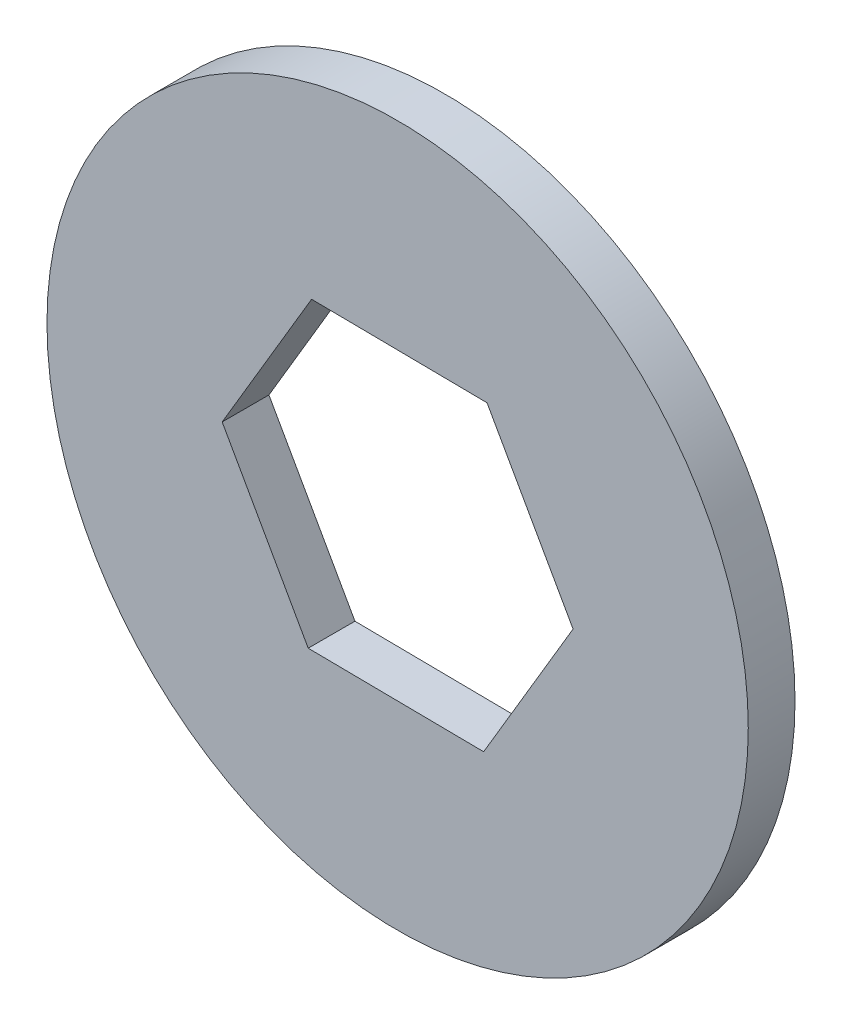
ISO-10303-21;
HEADER;
FILE_DESCRIPTION(('STEP AP214'),'2;1');
FILE_NAME('part.step','',(''),(''),'','','');
FILE_SCHEMA(('AUTOMOTIVE_DESIGN { 1 0 10303 214 1 1 1 1 }'));
ENDSEC;
DATA;
#1=APPLICATION_CONTEXT('core data for automotive mechanical design processes');
#2=APPLICATION_PROTOCOL_DEFINITION('international standard','automotive_design',2000,#1);
#3=PRODUCT_CONTEXT('',#1,'mechanical');
#4=PRODUCT('Part','Part','',(#3));
#5=PRODUCT_RELATED_PRODUCT_CATEGORY('part','',(#4));
#6=PRODUCT_DEFINITION_FORMATION('','',#4);
#7=PRODUCT_DEFINITION_CONTEXT('part definition',#1,'design');
#8=PRODUCT_DEFINITION('design','',#6,#7);
#9=PRODUCT_DEFINITION_SHAPE('','',#8);
#10=(LENGTH_UNIT() NAMED_UNIT(*) SI_UNIT(.MILLI.,.METRE.));
#11=(NAMED_UNIT(*) PLANE_ANGLE_UNIT() SI_UNIT($,.RADIAN.));
#12=(NAMED_UNIT(*) SI_UNIT($,.STERADIAN.) SOLID_ANGLE_UNIT());
#13=UNCERTAINTY_MEASURE_WITH_UNIT(LENGTH_MEASURE(1.E-05),#10,'distance_accuracy_value','');
#14=(GEOMETRIC_REPRESENTATION_CONTEXT(3) GLOBAL_UNCERTAINTY_ASSIGNED_CONTEXT((#13)) GLOBAL_UNIT_ASSIGNED_CONTEXT((#10,
#11,#12)) REPRESENTATION_CONTEXT('',''));
#15=CARTESIAN_POINT('',(0.,0.,0.));
#16=DIRECTION('',(0.,0.,1.));
#17=DIRECTION('',(1.,0.,0.));
#18=AXIS2_PLACEMENT_3D('',#15,#16,#17);
#19=CARTESIAN_POINT('',(0.,0.,2.));
#20=DIRECTION('',(0.,0.,1.));
#21=DIRECTION('',(1.,0.,0.));
#22=AXIS2_PLACEMENT_3D('',#19,#20,#21);
#23=PLANE('',#22);
#24=CARTESIAN_POINT('',(0.,0.,2.));
#25=DIRECTION('',(0.,0.,1.));
#26=DIRECTION('',(1.,0.,0.));
#27=AXIS2_PLACEMENT_3D('',#24,#25,#26);
#28=CIRCLE('',#27,15.);
#29=CARTESIAN_POINT('',(15.,0.,2.));
#30=VERTEX_POINT('',#29);
#31=EDGE_CURVE('E11',#30,#30,#28,.T.);
#32=ORIENTED_EDGE('',*,*,#31,.T.);
#33=EDGE_LOOP('',(#32));
#34=FACE_BOUND('',#33,.T.);
#35=DIRECTION('',(0.509636128131462,0.860390037659184,0.));
#36=VECTOR('',#35,1.);
#37=CARTESIAN_POINT('',(3.67998463230922,-6.54148656188342,2.));
#38=LINE('',#37,#36);
#39=CARTESIAN_POINT('',(3.67998463230922,-6.54148656188342,2.));
#40=VERTEX_POINT('',#39);
#41=CARTESIAN_POINT('',(7.50508585726017,-0.0837831038255902,2.));
#42=VERTEX_POINT('',#41);
#43=EDGE_CURVE('E108',#40,#42,#38,.T.);
#44=ORIENTED_EDGE('',*,*,#43,.F.);
#45=DIRECTION('',(0.999937693841634,-0.0111628148185959,0.));
#46=VECTOR('',#45,1.);
#47=CARTESIAN_POINT('',(-3.82510122495096,-6.45770345805782,2.));
#48=LINE('',#47,#46);
#49=CARTESIAN_POINT('',(-3.82510122495096,-6.45770345805782,2.));
#50=VERTEX_POINT('',#49);
#51=EDGE_CURVE('E99',#50,#40,#48,.T.);
#52=ORIENTED_EDGE('',*,*,#51,.F.);
#53=DIRECTION('',(0.490301565710172,-0.871552852477779,0.));
#54=VECTOR('',#53,1.);
#55=CARTESIAN_POINT('',(-7.50508585726017,0.083783103825592,2.));
#56=LINE('',#55,#54);
#57=CARTESIAN_POINT('',(-7.50508585726017,0.0837831038255923,2.));
#58=VERTEX_POINT('',#57);
#59=EDGE_CURVE('E133',#58,#50,#56,.T.);
#60=ORIENTED_EDGE('',*,*,#59,.F.);
#61=DIRECTION('',(-0.509636128131462,-0.860390037659184,0.));
#62=VECTOR('',#61,1.);
#63=CARTESIAN_POINT('',(-3.67998463230922,6.54148656188342,2.));
#64=LINE('',#63,#62);
#65=CARTESIAN_POINT('',(-3.67998463230922,6.54148656188342,2.));
#66=VERTEX_POINT('',#65);
#67=EDGE_CURVE('E130',#66,#58,#64,.T.);
#68=ORIENTED_EDGE('',*,*,#67,.F.);
#69=DIRECTION('',(-0.999937693841634,0.0111628148185958,0.));
#70=VECTOR('',#69,1.);
#71=CARTESIAN_POINT('',(3.82510122495095,6.45770345805783,2.));
#72=LINE('',#71,#70);
#73=CARTESIAN_POINT('',(3.82510122495095,6.45770345805783,2.));
#74=VERTEX_POINT('',#73);
#75=EDGE_CURVE('E125',#74,#66,#72,.T.);
#76=ORIENTED_EDGE('',*,*,#75,.F.);
#77=DIRECTION('',(-0.490301565710172,0.871552852477779,0.));
#78=VECTOR('',#77,1.);
#79=CARTESIAN_POINT('',(7.50508585726017,-0.0837831038255902,2.));
#80=LINE('',#79,#78);
#81=EDGE_CURVE('E121',#42,#74,#80,.T.);
#82=ORIENTED_EDGE('',*,*,#81,.F.);
#83=EDGE_LOOP('',(#44,#52,#60,#68,#76,#82));
#84=FACE_BOUND('',#83,.T.);
#85=ADVANCED_FACE('F45',(#34,#84),#23,.T.);
#86=CARTESIAN_POINT('',(0.,0.,0.));
#87=DIRECTION('',(0.,0.,1.));
#88=DIRECTION('',(1.,0.,0.));
#89=AXIS2_PLACEMENT_3D('',#86,#87,#88);
#90=PLANE('',#89);
#91=CARTESIAN_POINT('',(0.,0.,0.));
#92=DIRECTION('',(0.,0.,1.));
#93=DIRECTION('',(1.,0.,0.));
#94=AXIS2_PLACEMENT_3D('',#91,#92,#93);
#95=CIRCLE('',#94,15.);
#96=CARTESIAN_POINT('',(15.,0.,0.));
#97=VERTEX_POINT('',#96);
#98=EDGE_CURVE('E49',#97,#97,#95,.T.);
#99=ORIENTED_EDGE('',*,*,#98,.F.);
#100=EDGE_LOOP('',(#99));
#101=FACE_BOUND('',#100,.T.);
#102=DIRECTION('',(0.999937693841634,-0.0111628148185959,0.));
#103=VECTOR('',#102,1.);
#104=CARTESIAN_POINT('',(-3.82510122495096,-6.45770345805782,0.));
#105=LINE('',#104,#103);
#106=CARTESIAN_POINT('',(-3.82510122495096,-6.45770345805782,0.));
#107=VERTEX_POINT('',#106);
#108=CARTESIAN_POINT('',(3.67998463230922,-6.54148656188342,0.));
#109=VERTEX_POINT('',#108);
#110=EDGE_CURVE('E69',#107,#109,#105,.T.);
#111=ORIENTED_EDGE('',*,*,#110,.T.);
#112=DIRECTION('',(0.509636128131462,0.860390037659184,0.));
#113=VECTOR('',#112,1.);
#114=CARTESIAN_POINT('',(3.67998463230922,-6.54148656188342,0.));
#115=LINE('',#114,#113);
#116=CARTESIAN_POINT('',(7.50508585726017,-0.0837831038255902,0.));
#117=VERTEX_POINT('',#116);
#118=EDGE_CURVE('E115',#109,#117,#115,.T.);
#119=ORIENTED_EDGE('',*,*,#118,.T.);
#120=DIRECTION('',(-0.490301565710172,0.871552852477779,0.));
#121=VECTOR('',#120,1.);
#122=CARTESIAN_POINT('',(7.50508585726017,-0.0837831038255902,0.));
#123=LINE('',#122,#121);
#124=CARTESIAN_POINT('',(3.82510122495095,6.45770345805783,0.));
#125=VERTEX_POINT('',#124);
#126=EDGE_CURVE('E140',#117,#125,#123,.T.);
#127=ORIENTED_EDGE('',*,*,#126,.T.);
#128=DIRECTION('',(-0.999937693841634,0.0111628148185958,0.));
#129=VECTOR('',#128,1.);
#130=CARTESIAN_POINT('',(3.82510122495095,6.45770345805783,0.));
#131=LINE('',#130,#129);
#132=CARTESIAN_POINT('',(-3.67998463230922,6.54148656188342,0.));
#133=VERTEX_POINT('',#132);
#134=EDGE_CURVE('E144',#125,#133,#131,.T.);
#135=ORIENTED_EDGE('',*,*,#134,.T.);
#136=DIRECTION('',(-0.509636128131462,-0.860390037659184,0.));
#137=VECTOR('',#136,1.);
#138=CARTESIAN_POINT('',(-3.67998463230922,6.54148656188342,0.));
#139=LINE('',#138,#137);
#140=CARTESIAN_POINT('',(-7.50508585726017,0.083783103825592,0.));
#141=VERTEX_POINT('',#140);
#142=EDGE_CURVE('E148',#133,#141,#139,.T.);
#143=ORIENTED_EDGE('',*,*,#142,.T.);
#144=DIRECTION('',(0.490301565710172,-0.871552852477779,0.));
#145=VECTOR('',#144,1.);
#146=CARTESIAN_POINT('',(-7.50508585726017,0.083783103825592,0.));
#147=LINE('',#146,#145);
#148=EDGE_CURVE('E109',#141,#107,#147,.T.);
#149=ORIENTED_EDGE('',*,*,#148,.T.);
#150=EDGE_LOOP('',(#111,#119,#127,#135,#143,#149));
#151=FACE_BOUND('',#150,.T.);
#152=ADVANCED_FACE('F172',(#101,#151),#90,.F.);
#153=CARTESIAN_POINT('',(0.,0.,2.));
#154=DIRECTION('',(0.,0.,-1.));
#155=DIRECTION('',(-1.,0.,0.));
#156=AXIS2_PLACEMENT_3D('',#153,#154,#155);
#157=CYLINDRICAL_SURFACE('',#156,15.);
#158=ORIENTED_EDGE('',*,*,#31,.F.);
#159=EDGE_LOOP('',(#158));
#160=FACE_BOUND('',#159,.T.);
#161=ORIENTED_EDGE('',*,*,#98,.T.);
#162=EDGE_LOOP('',(#161));
#163=FACE_BOUND('',#162,.T.);
#164=ADVANCED_FACE('F47',(#160,#163),#157,.T.);
#165=CARTESIAN_POINT('',(-3.82510122495096,-6.45770345805782,2.));
#166=DIRECTION('',(0.0111628148185959,0.999937693841634,0.));
#167=DIRECTION('',(-0.999937693841634,0.0111628148185959,0.));
#168=AXIS2_PLACEMENT_3D('',#165,#166,#167);
#169=PLANE('',#168);
#170=ORIENTED_EDGE('',*,*,#110,.F.);
#171=DIRECTION('',(0.,0.,-1.));
#172=VECTOR('',#171,1.);
#173=CARTESIAN_POINT('',(-3.82510122495096,-6.45770345805782,2.));
#174=LINE('',#173,#172);
#175=EDGE_CURVE('E103',#50,#107,#174,.T.);
#176=ORIENTED_EDGE('',*,*,#175,.F.);
#177=ORIENTED_EDGE('',*,*,#51,.T.);
#178=DIRECTION('',(0.,0.,-1.));
#179=VECTOR('',#178,1.);
#180=CARTESIAN_POINT('',(3.67998463230922,-6.54148656188342,2.));
#181=LINE('',#180,#179);
#182=EDGE_CURVE('E102',#40,#109,#181,.T.);
#183=ORIENTED_EDGE('',*,*,#182,.T.);
#184=EDGE_LOOP('',(#170,#176,#177,#183));
#185=FACE_BOUND('',#184,.T.);
#186=ADVANCED_FACE('F101',(#185),#169,.T.);
#187=CARTESIAN_POINT('',(3.67998463230922,-6.54148656188342,2.));
#188=DIRECTION('',(-0.860390037659184,0.509636128131462,0.));
#189=DIRECTION('',(-0.509636128131462,-0.860390037659184,0.));
#190=AXIS2_PLACEMENT_3D('',#187,#188,#189);
#191=PLANE('',#190);
#192=ORIENTED_EDGE('',*,*,#118,.F.);
#193=ORIENTED_EDGE('',*,*,#182,.F.);
#194=ORIENTED_EDGE('',*,*,#43,.T.);
#195=DIRECTION('',(0.,0.,-1.));
#196=VECTOR('',#195,1.);
#197=CARTESIAN_POINT('',(7.50508585726017,-0.0837831038255902,2.));
#198=LINE('',#197,#196);
#199=EDGE_CURVE('E117',#42,#117,#198,.T.);
#200=ORIENTED_EDGE('',*,*,#199,.T.);
#201=EDGE_LOOP('',(#192,#193,#194,#200));
#202=FACE_BOUND('',#201,.T.);
#203=ADVANCED_FACE('F112',(#202),#191,.T.);
#204=CARTESIAN_POINT('',(7.50508585726017,-0.0837831038255902,2.));
#205=DIRECTION('',(-0.871552852477779,-0.490301565710172,0.));
#206=DIRECTION('',(0.490301565710172,-0.871552852477779,0.));
#207=AXIS2_PLACEMENT_3D('',#204,#205,#206);
#208=PLANE('',#207);
#209=ORIENTED_EDGE('',*,*,#126,.F.);
#210=ORIENTED_EDGE('',*,*,#199,.F.);
#211=ORIENTED_EDGE('',*,*,#81,.T.);
#212=DIRECTION('',(0.,0.,-1.));
#213=VECTOR('',#212,1.);
#214=CARTESIAN_POINT('',(3.82510122495095,6.45770345805783,2.));
#215=LINE('',#214,#213);
#216=EDGE_CURVE('E162',#74,#125,#215,.T.);
#217=ORIENTED_EDGE('',*,*,#216,.T.);
#218=EDGE_LOOP('',(#209,#210,#211,#217));
#219=FACE_BOUND('',#218,.T.);
#220=ADVANCED_FACE('F168',(#219),#208,.T.);
#221=CARTESIAN_POINT('',(3.82510122495095,6.45770345805783,2.));
#222=DIRECTION('',(-0.0111628148185958,-0.999937693841634,0.));
#223=DIRECTION('',(0.999937693841634,-0.0111628148185958,0.));
#224=AXIS2_PLACEMENT_3D('',#221,#222,#223);
#225=PLANE('',#224);
#226=ORIENTED_EDGE('',*,*,#134,.F.);
#227=ORIENTED_EDGE('',*,*,#216,.F.);
#228=ORIENTED_EDGE('',*,*,#75,.T.);
#229=DIRECTION('',(0.,0.,-1.));
#230=VECTOR('',#229,1.);
#231=CARTESIAN_POINT('',(-3.67998463230922,6.54148656188342,2.));
#232=LINE('',#231,#230);
#233=EDGE_CURVE('E159',#66,#133,#232,.T.);
#234=ORIENTED_EDGE('',*,*,#233,.T.);
#235=EDGE_LOOP('',(#226,#227,#228,#234));
#236=FACE_BOUND('',#235,.T.);
#237=ADVANCED_FACE('F180',(#236),#225,.T.);
#238=CARTESIAN_POINT('',(-3.67998463230922,6.54148656188342,2.));
#239=DIRECTION('',(0.860390037659184,-0.509636128131462,0.));
#240=DIRECTION('',(0.509636128131462,0.860390037659184,0.));
#241=AXIS2_PLACEMENT_3D('',#238,#239,#240);
#242=PLANE('',#241);
#243=ORIENTED_EDGE('',*,*,#142,.F.);
#244=ORIENTED_EDGE('',*,*,#233,.F.);
#245=ORIENTED_EDGE('',*,*,#67,.T.);
#246=DIRECTION('',(0.,0.,-1.));
#247=VECTOR('',#246,1.);
#248=CARTESIAN_POINT('',(-7.50508585726017,0.083783103825592,2.));
#249=LINE('',#248,#247);
#250=EDGE_CURVE('E61',#58,#141,#249,.T.);
#251=ORIENTED_EDGE('',*,*,#250,.T.);
#252=EDGE_LOOP('',(#243,#244,#245,#251));
#253=FACE_BOUND('',#252,.T.);
#254=ADVANCED_FACE('F178',(#253),#242,.T.);
#255=CARTESIAN_POINT('',(-7.50508585726017,0.083783103825592,2.));
#256=DIRECTION('',(0.871552852477779,0.490301565710172,0.));
#257=DIRECTION('',(-0.490301565710172,0.871552852477779,0.));
#258=AXIS2_PLACEMENT_3D('',#255,#256,#257);
#259=PLANE('',#258);
#260=ORIENTED_EDGE('',*,*,#148,.F.);
#261=ORIENTED_EDGE('',*,*,#250,.F.);
#262=ORIENTED_EDGE('',*,*,#59,.T.);
#263=ORIENTED_EDGE('',*,*,#175,.T.);
#264=EDGE_LOOP('',(#260,#261,#262,#263));
#265=FACE_BOUND('',#264,.T.);
#266=ADVANCED_FACE('F174',(#265),#259,.T.);
#267=CLOSED_SHELL('',(#85,#152,#164,#186,#203,#220,#237,#254,#266));
#268=MANIFOLD_SOLID_BREP('B2',#267);
#269=ADVANCED_BREP_SHAPE_REPRESENTATION('',(#18,#268),#14);
#270=SHAPE_DEFINITION_REPRESENTATION(#9,#269);
ENDSEC;
END-ISO-10303-21;
